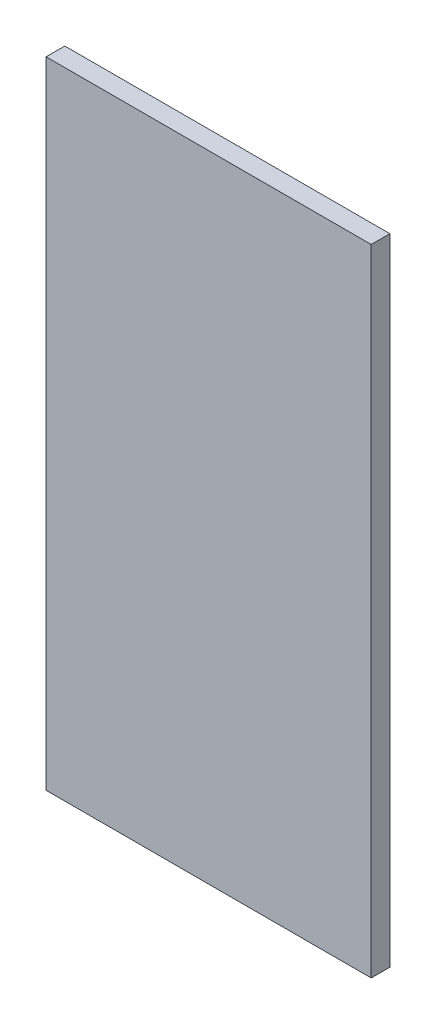
ISO-10303-21;
HEADER;
FILE_DESCRIPTION(('STEP AP214'),'2;1');
FILE_NAME('part.step','',(''),(''),'','','');
FILE_SCHEMA(('AUTOMOTIVE_DESIGN { 1 0 10303 214 1 1 1 1 }'));
ENDSEC;
DATA;
#1=APPLICATION_CONTEXT('core data for automotive mechanical design processes');
#2=APPLICATION_PROTOCOL_DEFINITION('international standard','automotive_design',2000,#1);
#3=PRODUCT_CONTEXT('',#1,'mechanical');
#4=PRODUCT('Part','Part','',(#3));
#5=PRODUCT_RELATED_PRODUCT_CATEGORY('part','',(#4));
#6=PRODUCT_DEFINITION_FORMATION('','',#4);
#7=PRODUCT_DEFINITION_CONTEXT('part definition',#1,'design');
#8=PRODUCT_DEFINITION('design','',#6,#7);
#9=PRODUCT_DEFINITION_SHAPE('','',#8);
#10=(LENGTH_UNIT() NAMED_UNIT(*) SI_UNIT(.MILLI.,.METRE.));
#11=(NAMED_UNIT(*) PLANE_ANGLE_UNIT() SI_UNIT($,.RADIAN.));
#12=(NAMED_UNIT(*) SI_UNIT($,.STERADIAN.) SOLID_ANGLE_UNIT());
#13=UNCERTAINTY_MEASURE_WITH_UNIT(LENGTH_MEASURE(1.E-05),#10,'distance_accuracy_value','');
#14=(GEOMETRIC_REPRESENTATION_CONTEXT(3) GLOBAL_UNCERTAINTY_ASSIGNED_CONTEXT((#13)) GLOBAL_UNIT_ASSIGNED_CONTEXT((#10,
#11,#12)) REPRESENTATION_CONTEXT('',''));
#15=CARTESIAN_POINT('',(0.,0.,0.));
#16=DIRECTION('',(0.,0.,1.));
#17=DIRECTION('',(1.,0.,0.));
#18=AXIS2_PLACEMENT_3D('',#15,#16,#17);
#19=CARTESIAN_POINT('',(87.,0.,5.));
#20=DIRECTION('',(0.,1.,0.));
#21=DIRECTION('',(0.,0.,1.));
#22=AXIS2_PLACEMENT_3D('',#19,#20,#21);
#23=PLANE('',#22);
#24=DIRECTION('',(1.,0.,0.));
#25=VECTOR('',#24,1.);
#26=CARTESIAN_POINT('',(87.,0.,0.));
#27=LINE('',#26,#25);
#28=CARTESIAN_POINT('',(0.,0.,0.));
#29=VERTEX_POINT('',#28);
#30=CARTESIAN_POINT('',(87.,0.,0.));
#31=VERTEX_POINT('',#30);
#32=EDGE_CURVE('E107',#29,#31,#27,.T.);
#33=ORIENTED_EDGE('',*,*,#32,.T.);
#34=DIRECTION('',(0.,0.,-1.));
#35=VECTOR('',#34,1.);
#36=CARTESIAN_POINT('',(87.,0.,5.));
#37=LINE('',#36,#35);
#38=CARTESIAN_POINT('',(87.,0.,5.));
#39=VERTEX_POINT('',#38);
#40=EDGE_CURVE('E11',#39,#31,#37,.T.);
#41=ORIENTED_EDGE('',*,*,#40,.F.);
#42=DIRECTION('',(1.,0.,0.));
#43=VECTOR('',#42,1.);
#44=CARTESIAN_POINT('',(87.,0.,5.));
#45=LINE('',#44,#43);
#46=CARTESIAN_POINT('',(0.,0.,5.));
#47=VERTEX_POINT('',#46);
#48=EDGE_CURVE('E91',#47,#39,#45,.T.);
#49=ORIENTED_EDGE('',*,*,#48,.F.);
#50=DIRECTION('',(0.,0.,-1.));
#51=VECTOR('',#50,1.);
#52=CARTESIAN_POINT('',(0.,0.,5.));
#53=LINE('',#52,#51);
#54=EDGE_CURVE('E103',#47,#29,#53,.T.);
#55=ORIENTED_EDGE('',*,*,#54,.T.);
#56=EDGE_LOOP('',(#33,#41,#49,#55));
#57=FACE_BOUND('',#56,.T.);
#58=ADVANCED_FACE('F39',(#57),#23,.F.);
#59=CARTESIAN_POINT('',(87.,170.,5.));
#60=DIRECTION('',(-1.,0.,0.));
#61=DIRECTION('',(0.,0.,1.));
#62=AXIS2_PLACEMENT_3D('',#59,#60,#61);
#63=PLANE('',#62);
#64=DIRECTION('',(0.,1.,0.));
#65=VECTOR('',#64,1.);
#66=CARTESIAN_POINT('',(87.,170.,0.));
#67=LINE('',#66,#65);
#68=CARTESIAN_POINT('',(87.,170.,0.));
#69=VERTEX_POINT('',#68);
#70=EDGE_CURVE('E96',#31,#69,#67,.T.);
#71=ORIENTED_EDGE('',*,*,#70,.T.);
#72=DIRECTION('',(0.,0.,-1.));
#73=VECTOR('',#72,1.);
#74=CARTESIAN_POINT('',(87.,170.,5.));
#75=LINE('',#74,#73);
#76=CARTESIAN_POINT('',(87.,170.,5.));
#77=VERTEX_POINT('',#76);
#78=EDGE_CURVE('E48',#77,#69,#75,.T.);
#79=ORIENTED_EDGE('',*,*,#78,.F.);
#80=DIRECTION('',(0.,1.,0.));
#81=VECTOR('',#80,1.);
#82=CARTESIAN_POINT('',(87.,170.,5.));
#83=LINE('',#82,#81);
#84=EDGE_CURVE('E86',#39,#77,#83,.T.);
#85=ORIENTED_EDGE('',*,*,#84,.F.);
#86=ORIENTED_EDGE('',*,*,#40,.T.);
#87=EDGE_LOOP('',(#71,#79,#85,#86));
#88=FACE_BOUND('',#87,.T.);
#89=ADVANCED_FACE('F95',(#88),#63,.F.);
#90=CARTESIAN_POINT('',(0.,170.,5.));
#91=DIRECTION('',(0.,-1.,0.));
#92=DIRECTION('',(0.,0.,-1.));
#93=AXIS2_PLACEMENT_3D('',#90,#91,#92);
#94=PLANE('',#93);
#95=DIRECTION('',(-1.,0.,0.));
#96=VECTOR('',#95,1.);
#97=CARTESIAN_POINT('',(0.,170.,0.));
#98=LINE('',#97,#96);
#99=CARTESIAN_POINT('',(0.,170.,0.));
#100=VERTEX_POINT('',#99);
#101=EDGE_CURVE('E73',#69,#100,#98,.T.);
#102=ORIENTED_EDGE('',*,*,#101,.T.);
#103=DIRECTION('',(0.,0.,-1.));
#104=VECTOR('',#103,1.);
#105=CARTESIAN_POINT('',(0.,170.,5.));
#106=LINE('',#105,#104);
#107=CARTESIAN_POINT('',(0.,170.,5.));
#108=VERTEX_POINT('',#107);
#109=EDGE_CURVE('E98',#108,#100,#106,.T.);
#110=ORIENTED_EDGE('',*,*,#109,.F.);
#111=DIRECTION('',(-1.,0.,0.));
#112=VECTOR('',#111,1.);
#113=CARTESIAN_POINT('',(0.,170.,5.));
#114=LINE('',#113,#112);
#115=EDGE_CURVE('E89',#77,#108,#114,.T.);
#116=ORIENTED_EDGE('',*,*,#115,.F.);
#117=ORIENTED_EDGE('',*,*,#78,.T.);
#118=EDGE_LOOP('',(#102,#110,#116,#117));
#119=FACE_BOUND('',#118,.T.);
#120=ADVANCED_FACE('F99',(#119),#94,.F.);
#121=CARTESIAN_POINT('',(0.,0.,5.));
#122=DIRECTION('',(1.,0.,0.));
#123=DIRECTION('',(0.,0.,-1.));
#124=AXIS2_PLACEMENT_3D('',#121,#122,#123);
#125=PLANE('',#124);
#126=DIRECTION('',(0.,-1.,0.));
#127=VECTOR('',#126,1.);
#128=CARTESIAN_POINT('',(0.,0.,0.));
#129=LINE('',#128,#127);
#130=EDGE_CURVE('E79',#100,#29,#129,.T.);
#131=ORIENTED_EDGE('',*,*,#130,.T.);
#132=ORIENTED_EDGE('',*,*,#54,.F.);
#133=DIRECTION('',(0.,-1.,0.));
#134=VECTOR('',#133,1.);
#135=CARTESIAN_POINT('',(0.,0.,5.));
#136=LINE('',#135,#134);
#137=EDGE_CURVE('E56',#108,#47,#136,.T.);
#138=ORIENTED_EDGE('',*,*,#137,.F.);
#139=ORIENTED_EDGE('',*,*,#109,.T.);
#140=EDGE_LOOP('',(#131,#132,#138,#139));
#141=FACE_BOUND('',#140,.T.);
#142=ADVANCED_FACE('F120',(#141),#125,.F.);
#143=CARTESIAN_POINT('',(0.,0.,5.));
#144=DIRECTION('',(0.,0.,-1.));
#145=DIRECTION('',(-1.,0.,0.));
#146=AXIS2_PLACEMENT_3D('',#143,#144,#145);
#147=PLANE('',#146);
#148=ORIENTED_EDGE('',*,*,#48,.T.);
#149=ORIENTED_EDGE('',*,*,#84,.T.);
#150=ORIENTED_EDGE('',*,*,#115,.T.);
#151=ORIENTED_EDGE('',*,*,#137,.T.);
#152=EDGE_LOOP('',(#148,#149,#150,#151));
#153=FACE_BOUND('',#152,.T.);
#154=ADVANCED_FACE('F87',(#153),#147,.F.);
#155=CARTESIAN_POINT('',(0.,0.,0.));
#156=DIRECTION('',(0.,0.,-1.));
#157=DIRECTION('',(-1.,0.,0.));
#158=AXIS2_PLACEMENT_3D('',#155,#156,#157);
#159=PLANE('',#158);
#160=ORIENTED_EDGE('',*,*,#32,.F.);
#161=ORIENTED_EDGE('',*,*,#130,.F.);
#162=ORIENTED_EDGE('',*,*,#101,.F.);
#163=ORIENTED_EDGE('',*,*,#70,.F.);
#164=EDGE_LOOP('',(#160,#161,#162,#163));
#165=FACE_BOUND('',#164,.T.);
#166=ADVANCED_FACE('F123',(#165),#159,.T.);
#167=CLOSED_SHELL('',(#58,#89,#120,#142,#154,#166));
#168=MANIFOLD_SOLID_BREP('B2',#167);
#169=ADVANCED_BREP_SHAPE_REPRESENTATION('',(#18,#168),#14);
#170=SHAPE_DEFINITION_REPRESENTATION(#9,#169);
ENDSEC;
END-ISO-10303-21;
